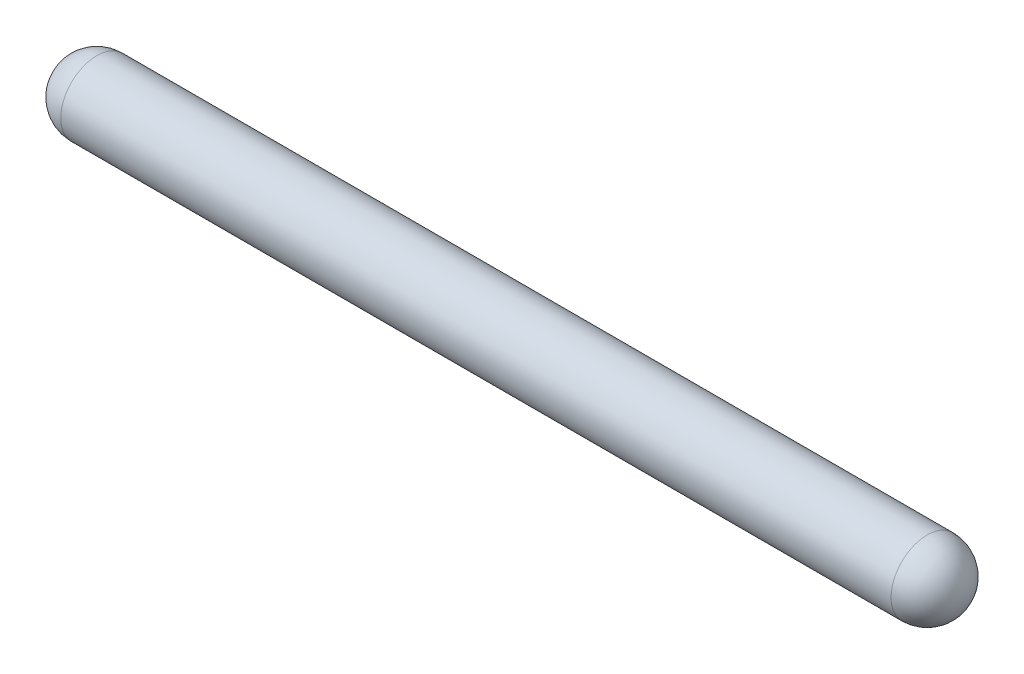
ISO-10303-21;
HEADER;
FILE_DESCRIPTION(('STEP AP214'),'2;1');
FILE_NAME('part.step','',(''),(''),'','','');
FILE_SCHEMA(('AUTOMOTIVE_DESIGN { 1 0 10303 214 1 1 1 1 }'));
ENDSEC;
DATA;
#1=APPLICATION_CONTEXT('core data for automotive mechanical design processes');
#2=APPLICATION_PROTOCOL_DEFINITION('international standard','automotive_design',2000,#1);
#3=PRODUCT_CONTEXT('',#1,'mechanical');
#4=PRODUCT('Part','Part','',(#3));
#5=PRODUCT_RELATED_PRODUCT_CATEGORY('part','',(#4));
#6=PRODUCT_DEFINITION_FORMATION('','',#4);
#7=PRODUCT_DEFINITION_CONTEXT('part definition',#1,'design');
#8=PRODUCT_DEFINITION('design','',#6,#7);
#9=PRODUCT_DEFINITION_SHAPE('','',#8);
#10=(LENGTH_UNIT() NAMED_UNIT(*) SI_UNIT(.MILLI.,.METRE.));
#11=(NAMED_UNIT(*) PLANE_ANGLE_UNIT() SI_UNIT($,.RADIAN.));
#12=(NAMED_UNIT(*) SI_UNIT($,.STERADIAN.) SOLID_ANGLE_UNIT());
#13=UNCERTAINTY_MEASURE_WITH_UNIT(LENGTH_MEASURE(1.E-05),#10,'distance_accuracy_value','');
#14=(GEOMETRIC_REPRESENTATION_CONTEXT(3) GLOBAL_UNCERTAINTY_ASSIGNED_CONTEXT((#13)) GLOBAL_UNIT_ASSIGNED_CONTEXT((#10,
#11,#12)) REPRESENTATION_CONTEXT('',''));
#15=CARTESIAN_POINT('',(0.,0.,0.));
#16=DIRECTION('',(0.,0.,1.));
#17=DIRECTION('',(1.,0.,0.));
#18=AXIS2_PLACEMENT_3D('',#15,#16,#17);
#19=CARTESIAN_POINT('',(0.254,0.,0.));
#20=DIRECTION('',(-1.,0.,0.));
#21=DIRECTION('',(0.,1.,0.));
#22=AXIS2_PLACEMENT_3D('',#19,#20,#21);
#23=SPHERICAL_SURFACE('',#22,0.254);
#24=CARTESIAN_POINT('',(0.254,0.,0.));
#25=DIRECTION('',(-1.,0.,0.));
#26=DIRECTION('',(0.,0.,1.));
#27=AXIS2_PLACEMENT_3D('',#24,#25,#26);
#28=CIRCLE('',#27,0.254);
#29=CARTESIAN_POINT('',(0.254,0.,0.254));
#30=VERTEX_POINT('',#29);
#31=EDGE_CURVE('E20',#30,#30,#28,.T.);
#32=ORIENTED_EDGE('',*,*,#31,.T.);
#33=EDGE_LOOP('',(#32));
#34=FACE_BOUND('',#33,.T.);
#35=ADVANCED_FACE('F14',(#34),#23,.T.);
#36=CARTESIAN_POINT('',(6.09599999999999,0.,0.));
#37=DIRECTION('',(-1.,0.,0.));
#38=DIRECTION('',(0.,1.,0.));
#39=AXIS2_PLACEMENT_3D('',#36,#37,#38);
#40=SPHERICAL_SURFACE('',#39,0.254000000000003);
#41=CARTESIAN_POINT('',(6.09599999999999,0.,0.));
#42=DIRECTION('',(-1.,0.,0.));
#43=DIRECTION('',(0.,0.,1.));
#44=AXIS2_PLACEMENT_3D('',#41,#42,#43);
#45=CIRCLE('',#44,0.254000000000003);
#46=CARTESIAN_POINT('',(6.09599999999999,0.,0.254000000000003));
#47=VERTEX_POINT('',#46);
#48=EDGE_CURVE('E10',#47,#47,#45,.T.);
#49=ORIENTED_EDGE('',*,*,#48,.F.);
#50=EDGE_LOOP('',(#49));
#51=FACE_BOUND('',#50,.T.);
#52=ADVANCED_FACE('F29',(#51),#40,.T.);
#53=CARTESIAN_POINT('',(0.,0.,0.));
#54=DIRECTION('',(-1.,0.,0.));
#55=DIRECTION('',(0.,0.,1.));
#56=AXIS2_PLACEMENT_3D('',#53,#54,#55);
#57=CYLINDRICAL_SURFACE('',#56,0.254000000000002);
#58=ORIENTED_EDGE('',*,*,#31,.F.);
#59=EDGE_LOOP('',(#58));
#60=FACE_BOUND('',#59,.T.);
#61=ORIENTED_EDGE('',*,*,#48,.T.);
#62=EDGE_LOOP('',(#61));
#63=FACE_BOUND('',#62,.T.);
#64=ADVANCED_FACE('F27',(#60,#63),#57,.T.);
#65=CLOSED_SHELL('',(#35,#52,#64));
#66=MANIFOLD_SOLID_BREP('B1',#65);
#67=ADVANCED_BREP_SHAPE_REPRESENTATION('',(#18,#66),#14);
#68=SHAPE_DEFINITION_REPRESENTATION(#9,#67);
ENDSEC;
END-ISO-10303-21;
